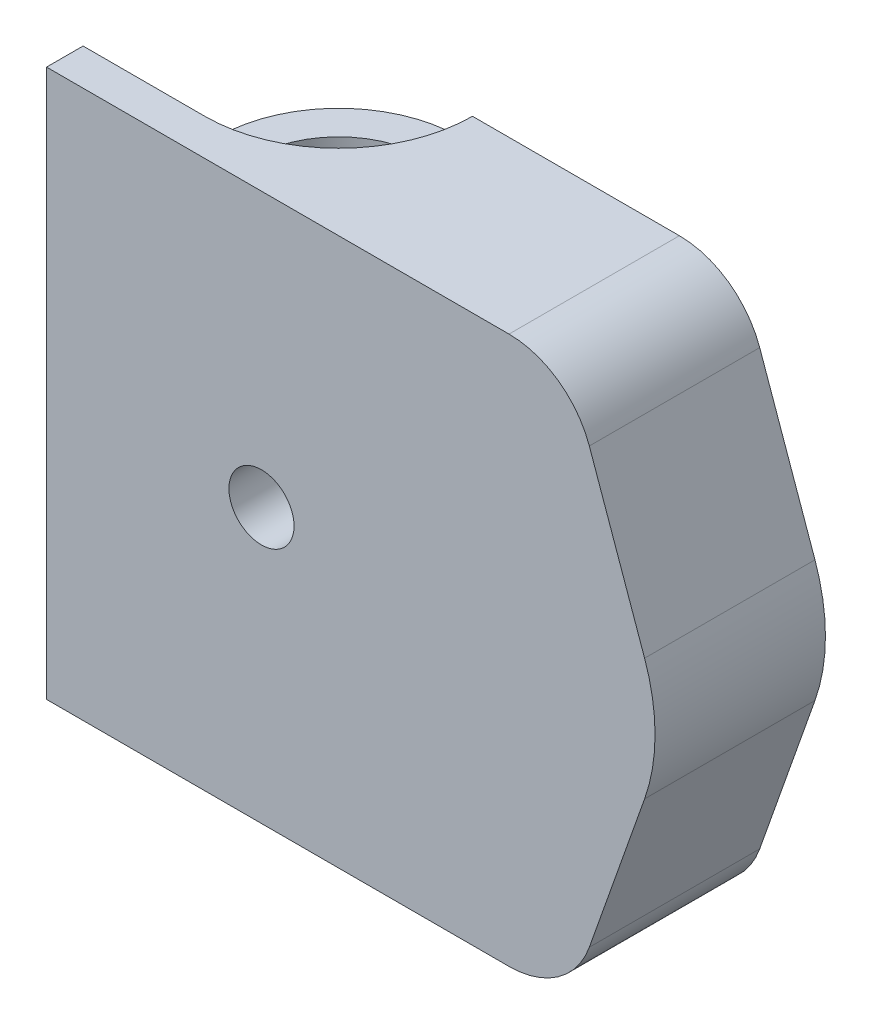
ISO-10303-21;
HEADER;
FILE_DESCRIPTION(('STEP AP214'),'2;1');
FILE_NAME('part.step','',(''),(''),'','','');
FILE_SCHEMA(('AUTOMOTIVE_DESIGN { 1 0 10303 214 1 1 1 1 }'));
ENDSEC;
DATA;
#1=APPLICATION_CONTEXT('core data for automotive mechanical design processes');
#2=APPLICATION_PROTOCOL_DEFINITION('international standard','automotive_design',2000,#1);
#3=PRODUCT_CONTEXT('',#1,'mechanical');
#4=PRODUCT('Part','Part','',(#3));
#5=PRODUCT_RELATED_PRODUCT_CATEGORY('part','',(#4));
#6=PRODUCT_DEFINITION_FORMATION('','',#4);
#7=PRODUCT_DEFINITION_CONTEXT('part definition',#1,'design');
#8=PRODUCT_DEFINITION('design','',#6,#7);
#9=PRODUCT_DEFINITION_SHAPE('','',#8);
#10=(LENGTH_UNIT() NAMED_UNIT(*) SI_UNIT(.MILLI.,.METRE.));
#11=(NAMED_UNIT(*) PLANE_ANGLE_UNIT() SI_UNIT($,.RADIAN.));
#12=(NAMED_UNIT(*) SI_UNIT($,.STERADIAN.) SOLID_ANGLE_UNIT());
#13=UNCERTAINTY_MEASURE_WITH_UNIT(LENGTH_MEASURE(1.E-05),#10,'distance_accuracy_value','');
#14=(GEOMETRIC_REPRESENTATION_CONTEXT(3) GLOBAL_UNCERTAINTY_ASSIGNED_CONTEXT((#13)) GLOBAL_UNIT_ASSIGNED_CONTEXT((#10,
#11,#12)) REPRESENTATION_CONTEXT('',''));
#15=CARTESIAN_POINT('',(0.,0.,0.));
#16=DIRECTION('',(0.,0.,1.));
#17=DIRECTION('',(1.,0.,0.));
#18=AXIS2_PLACEMENT_3D('',#15,#16,#17);
#19=CARTESIAN_POINT('',(162.686214745336,25.0741943489475,0.));
#20=DIRECTION('',(0.,0.,1.));
#21=DIRECTION('',(1.,0.,0.));
#22=AXIS2_PLACEMENT_3D('',#19,#20,#21);
#23=PLANE('',#22);
#24=DIRECTION('',(0.,1.,0.));
#25=VECTOR('',#24,1.);
#26=CARTESIAN_POINT('',(157.827472335938,64.3719632178711,0.));
#27=LINE('',#26,#25);
#28=CARTESIAN_POINT('',(157.827472335938,64.3719632178711,0.));
#29=VERTEX_POINT('',#28);
#30=CARTESIAN_POINT('',(157.827472335938,70.6969632178711,0.));
#31=VERTEX_POINT('',#30);
#32=EDGE_CURVE('E354',#29,#31,#27,.T.);
#33=ORIENTED_EDGE('',*,*,#32,.T.);
#34=DIRECTION('',(1.,0.,0.));
#35=VECTOR('',#34,1.);
#36=CARTESIAN_POINT('',(162.686214745336,70.6969632178711,0.));
#37=LINE('',#36,#35);
#38=CARTESIAN_POINT('',(157.897909709804,70.6969632178711,0.));
#39=VERTEX_POINT('',#38);
#40=EDGE_CURVE('E309',#31,#39,#37,.T.);
#41=ORIENTED_EDGE('',*,*,#40,.T.);
#42=DIRECTION('',(0.500000000000001,0.866025403784438,0.));
#43=VECTOR('',#42,1.);
#44=CARTESIAN_POINT('',(139.33974755295,38.5532834670979,0.));
#45=LINE('',#44,#43);
#46=CARTESIAN_POINT('',(160.308347083671,74.8719632178711,0.));
#47=VERTEX_POINT('',#46);
#48=EDGE_CURVE('E312',#39,#47,#45,.T.);
#49=ORIENTED_EDGE('',*,*,#48,.T.);
#50=DIRECTION('',(-0.5,0.866025403784439,0.));
#51=VECTOR('',#50,1.);
#52=CARTESIAN_POINT('',(182.465880445224,36.4939896652589,0.));
#53=LINE('',#52,#51);
#54=CARTESIAN_POINT('',(157.897909709804,79.0469632178711,0.));
#55=VERTEX_POINT('',#54);
#56=EDGE_CURVE('E315',#47,#55,#53,.T.);
#57=ORIENTED_EDGE('',*,*,#56,.T.);
#58=DIRECTION('',(-1.,0.,0.));
#59=VECTOR('',#58,1.);
#60=CARTESIAN_POINT('',(162.686214745336,79.0469632178711,0.));
#61=LINE('',#60,#59);
#62=CARTESIAN_POINT('',(157.827472335938,79.0469632178711,0.));
#63=VERTEX_POINT('',#62);
#64=EDGE_CURVE('E287',#55,#63,#61,.T.);
#65=ORIENTED_EDGE('',*,*,#64,.T.);
#66=DIRECTION('',(0.,1.,0.));
#67=VECTOR('',#66,1.);
#68=CARTESIAN_POINT('',(157.827472335938,64.3719632178711,0.));
#69=LINE('',#68,#67);
#70=CARTESIAN_POINT('',(157.827472335938,85.3719632178711,0.));
#71=VERTEX_POINT('',#70);
#72=EDGE_CURVE('E391',#63,#71,#69,.T.);
#73=ORIENTED_EDGE('',*,*,#72,.T.);
#74=DIRECTION('',(-1.,0.,0.));
#75=VECTOR('',#74,1.);
#76=CARTESIAN_POINT('',(157.827472335938,85.3719632178711,0.));
#77=LINE('',#76,#75);
#78=CARTESIAN_POINT('',(158.827472335938,85.3719632178711,0.));
#79=VERTEX_POINT('',#78);
#80=EDGE_CURVE('E318',#79,#71,#77,.T.);
#81=ORIENTED_EDGE('',*,*,#80,.F.);
#82=DIRECTION('',(0.,-1.,0.));
#83=VECTOR('',#82,1.);
#84=CARTESIAN_POINT('',(158.827472335938,97.3719632178711,0.));
#85=LINE('',#84,#83);
#86=CARTESIAN_POINT('',(158.827472335938,97.3719632178711,0.));
#87=VERTEX_POINT('',#86);
#88=EDGE_CURVE('E321',#87,#79,#85,.T.);
#89=ORIENTED_EDGE('',*,*,#88,.F.);
#90=DIRECTION('',(-1.,0.,0.));
#91=VECTOR('',#90,1.);
#92=CARTESIAN_POINT('',(162.686214745336,97.3719632178711,0.));
#93=LINE('',#92,#91);
#94=CARTESIAN_POINT('',(175.827472335938,97.3719632178711,0.));
#95=VERTEX_POINT('',#94);
#96=EDGE_CURVE('E371',#95,#87,#93,.T.);
#97=ORIENTED_EDGE('',*,*,#96,.F.);
#98=CARTESIAN_POINT('',(175.827472335938,90.3719632178711,0.));
#99=DIRECTION('',(0.,0.,1.));
#100=DIRECTION('',(1.,0.,0.));
#101=AXIS2_PLACEMENT_3D('',#98,#99,#100);
#102=CIRCLE('',#101,7.);
#103=CARTESIAN_POINT('',(182.426294195061,92.7076751161052,0.));
#104=VERTEX_POINT('',#103);
#105=EDGE_CURVE('E368',#104,#95,#102,.T.);
#106=ORIENTED_EDGE('',*,*,#105,.F.);
#107=DIRECTION('',(0.333673128319162,-0.942688837017658,0.));
#108=VECTOR('',#107,1.);
#109=CARTESIAN_POINT('',(201.502584897519,38.8135950399,0.));
#110=LINE('',#109,#108);
#111=CARTESIAN_POINT('',(186.967804891203,79.8770601426586,0.));
#112=VERTEX_POINT('',#111);
#113=EDGE_CURVE('E365',#104,#112,#110,.T.);
#114=ORIENTED_EDGE('',*,*,#113,.T.);
#115=CARTESIAN_POINT('',(172.827472335938,74.8719632178711,0.));
#116=DIRECTION('',(0.,0.,1.));
#117=DIRECTION('',(1.,0.,0.));
#118=AXIS2_PLACEMENT_3D('',#115,#116,#117);
#119=CIRCLE('',#118,15.);
#120=CARTESIAN_POINT('',(186.967804891203,69.8668662930836,0.));
#121=VERTEX_POINT('',#120);
#122=EDGE_CURVE('E362',#121,#112,#119,.T.);
#123=ORIENTED_EDGE('',*,*,#122,.F.);
#124=DIRECTION('',(0.333673128319162,0.942688837017658,0.));
#125=VECTOR('',#124,1.);
#126=CARTESIAN_POINT('',(170.17481514717,22.4235373933423,0.));
#127=LINE('',#126,#125);
#128=CARTESIAN_POINT('',(182.426294195061,57.036251319637,0.));
#129=VERTEX_POINT('',#128);
#130=EDGE_CURVE('E357',#129,#121,#127,.T.);
#131=ORIENTED_EDGE('',*,*,#130,.F.);
#132=CARTESIAN_POINT('',(175.827472335938,59.3719632178711,0.));
#133=DIRECTION('',(0.,0.,1.));
#134=DIRECTION('',(1.,0.,0.));
#135=AXIS2_PLACEMENT_3D('',#132,#133,#134);
#136=CIRCLE('',#135,7.);
#137=CARTESIAN_POINT('',(175.827472335938,52.3719632178711,0.));
#138=VERTEX_POINT('',#137);
#139=EDGE_CURVE('E377',#138,#129,#136,.T.);
#140=ORIENTED_EDGE('',*,*,#139,.F.);
#141=DIRECTION('',(-1.,0.,0.));
#142=VECTOR('',#141,1.);
#143=CARTESIAN_POINT('',(162.686214745336,52.3719632178711,0.));
#144=LINE('',#143,#142);
#145=CARTESIAN_POINT('',(158.827472335938,52.3719632178711,0.));
#146=VERTEX_POINT('',#145);
#147=EDGE_CURVE('E374',#138,#146,#144,.T.);
#148=ORIENTED_EDGE('',*,*,#147,.T.);
#149=DIRECTION('',(0.,1.,0.));
#150=VECTOR('',#149,1.);
#151=CARTESIAN_POINT('',(158.827472335938,52.3719632178711,0.));
#152=LINE('',#151,#150);
#153=CARTESIAN_POINT('',(158.827472335938,64.3719632178711,0.));
#154=VERTEX_POINT('',#153);
#155=EDGE_CURVE('E326',#146,#154,#152,.T.);
#156=ORIENTED_EDGE('',*,*,#155,.T.);
#157=DIRECTION('',(1.,0.,0.));
#158=VECTOR('',#157,1.);
#159=CARTESIAN_POINT('',(157.827472335938,64.3719632178711,0.));
#160=LINE('',#159,#158);
#161=EDGE_CURVE('E324',#29,#154,#160,.T.);
#162=ORIENTED_EDGE('',*,*,#161,.F.);
#163=EDGE_LOOP('',(#33,#41,#49,#57,#65,#73,#81,#89,#97,#106,#114,#123,#131,#140,#148,#156,#162));
#164=FACE_BOUND('',#163,.T.);
#165=CARTESIAN_POINT('',(173.633919605938,74.8719632178711,0.));
#166=DIRECTION('',(0.,0.,1.));
#167=DIRECTION('',(1.,0.,0.));
#168=AXIS2_PLACEMENT_3D('',#165,#166,#167);
#169=CIRCLE('',#168,6.34999999999999);
#170=CARTESIAN_POINT('',(179.983919605938,74.8719632178711,0.));
#171=VERTEX_POINT('',#170);
#172=EDGE_CURVE('E406',#171,#171,#169,.F.);
#173=ORIENTED_EDGE('',*,*,#172,.F.);
#174=EDGE_LOOP('',(#173));
#175=FACE_BOUND('',#174,.T.);
#176=ADVANCED_FACE('F35',(#164,#175),#23,.F.);
#177=CARTESIAN_POINT('',(160.308347083671,74.8719632178711,-10.));
#178=DIRECTION('',(0.866025403784439,0.5,0.));
#179=DIRECTION('',(-0.5,0.866025403784439,0.));
#180=AXIS2_PLACEMENT_3D('',#177,#178,#179);
#181=PLANE('',#180);
#182=DIRECTION('',(0.,0.,1.));
#183=VECTOR('',#182,1.);
#184=CARTESIAN_POINT('',(160.308347083671,74.8719632178711,-10.));
#185=LINE('',#184,#183);
#186=CARTESIAN_POINT('',(160.308347083671,74.8719632178711,5.));
#187=VERTEX_POINT('',#186);
#188=EDGE_CURVE('E285',#47,#187,#185,.T.);
#189=ORIENTED_EDGE('',*,*,#188,.T.);
#190=DIRECTION('',(-0.500000000000001,0.866025403784438,0.));
#191=VECTOR('',#190,1.);
#192=CARTESIAN_POINT('',(160.308347083671,74.8719632178711,5.));
#193=LINE('',#192,#191);
#194=CARTESIAN_POINT('',(157.897909709804,79.0469632178711,5.));
#195=VERTEX_POINT('',#194);
#196=EDGE_CURVE('E281',#187,#195,#193,.T.);
#197=ORIENTED_EDGE('',*,*,#196,.T.);
#198=DIRECTION('',(0.,0.,1.));
#199=VECTOR('',#198,1.);
#200=CARTESIAN_POINT('',(157.897909709804,79.0469632178711,-10.));
#201=LINE('',#200,#199);
#202=EDGE_CURVE('E284',#55,#195,#201,.T.);
#203=ORIENTED_EDGE('',*,*,#202,.F.);
#204=ORIENTED_EDGE('',*,*,#56,.F.);
#205=EDGE_LOOP('',(#189,#197,#203,#204));
#206=FACE_BOUND('',#205,.T.);
#207=ADVANCED_FACE('F472',(#206),#181,.F.);
#208=CARTESIAN_POINT('',(157.897909709804,70.6969632178711,-10.));
#209=DIRECTION('',(0.866025403784438,-0.500000000000001,0.));
#210=DIRECTION('',(0.500000000000001,0.866025403784438,0.));
#211=AXIS2_PLACEMENT_3D('',#208,#209,#210);
#212=PLANE('',#211);
#213=DIRECTION('',(0.,0.,1.));
#214=VECTOR('',#213,1.);
#215=CARTESIAN_POINT('',(157.897909709804,70.6969632178711,-10.));
#216=LINE('',#215,#214);
#217=CARTESIAN_POINT('',(157.897909709804,70.6969632178711,5.));
#218=VERTEX_POINT('',#217);
#219=EDGE_CURVE('E288',#39,#218,#216,.T.);
#220=ORIENTED_EDGE('',*,*,#219,.T.);
#221=DIRECTION('',(0.499999999999999,0.866025403784439,0.));
#222=VECTOR('',#221,1.);
#223=CARTESIAN_POINT('',(157.897909709804,70.6969632178711,5.));
#224=LINE('',#223,#222);
#225=EDGE_CURVE('E278',#218,#187,#224,.T.);
#226=ORIENTED_EDGE('',*,*,#225,.T.);
#227=ORIENTED_EDGE('',*,*,#188,.F.);
#228=ORIENTED_EDGE('',*,*,#48,.F.);
#229=EDGE_LOOP('',(#220,#226,#227,#228));
#230=FACE_BOUND('',#229,.T.);
#231=ADVANCED_FACE('F468',(#230),#212,.F.);
#232=CARTESIAN_POINT('',(153.077034962071,70.6969632178711,-10.));
#233=DIRECTION('',(0.,-1.,0.));
#234=DIRECTION('',(0.,0.,-1.));
#235=AXIS2_PLACEMENT_3D('',#232,#233,#234);
#236=PLANE('',#235);
#237=DIRECTION('',(1.,0.,0.));
#238=VECTOR('',#237,1.);
#239=CARTESIAN_POINT('',(153.077034962071,70.6969632178711,5.));
#240=LINE('',#239,#238);
#241=CARTESIAN_POINT('',(153.077034962071,70.6969632178711,5.));
#242=VERTEX_POINT('',#241);
#243=EDGE_CURVE('E275',#242,#218,#240,.T.);
#244=ORIENTED_EDGE('',*,*,#243,.T.);
#245=ORIENTED_EDGE('',*,*,#219,.F.);
#246=ORIENTED_EDGE('',*,*,#40,.F.);
#247=CARTESIAN_POINT('',(147.827472335938,70.6969632178711,0.));
#248=DIRECTION('',(0.,-1.,0.));
#249=DIRECTION('',(0.,0.,-1.));
#250=AXIS2_PLACEMENT_3D('',#247,#248,#249);
#251=CIRCLE('',#250,9.99999999999999);
#252=CARTESIAN_POINT('',(153.077034962071,70.6969632178711,-8.51129204259292));
#253=VERTEX_POINT('',#252);
#254=EDGE_CURVE('E404',#31,#253,#251,.F.);
#255=ORIENTED_EDGE('',*,*,#254,.T.);
#256=DIRECTION('',(0.,0.,1.));
#257=VECTOR('',#256,1.);
#258=CARTESIAN_POINT('',(153.077034962071,70.6969632178711,-10.));
#259=LINE('',#258,#257);
#260=EDGE_CURVE('E290',#253,#242,#259,.T.);
#261=ORIENTED_EDGE('',*,*,#260,.T.);
#262=EDGE_LOOP('',(#244,#245,#246,#255,#261));
#263=FACE_BOUND('',#262,.T.);
#264=ADVANCED_FACE('F463',(#263),#236,.F.);
#265=CARTESIAN_POINT('',(150.666597588204,74.8719632178711,-10.));
#266=DIRECTION('',(-0.866025403784438,-0.500000000000002,0.));
#267=DIRECTION('',(0.500000000000002,-0.866025403784438,0.));
#268=AXIS2_PLACEMENT_3D('',#265,#266,#267);
#269=PLANE('',#268);
#270=DIRECTION('',(0.500000000000003,-0.866025403784437,0.));
#271=VECTOR('',#270,1.);
#272=CARTESIAN_POINT('',(150.666597588204,74.8719632178711,5.));
#273=LINE('',#272,#271);
#274=CARTESIAN_POINT('',(150.666597588204,74.8719632178711,5.));
#275=VERTEX_POINT('',#274);
#276=EDGE_CURVE('E273',#275,#242,#273,.T.);
#277=ORIENTED_EDGE('',*,*,#276,.T.);
#278=ORIENTED_EDGE('',*,*,#260,.F.);
#279=CARTESIAN_POINT('',(147.827472335938,79.7894724038484,0.));
#280=DIRECTION('',(-0.866025403784438,-0.500000000000002,0.));
#281=DIRECTION('',(-0.500000000000002,0.866025403784438,0.));
#282=AXIS2_PLACEMENT_3D('',#279,#280,#281);
#283=ELLIPSE('',#282,19.9999999999999,9.99999999999999);
#284=CARTESIAN_POINT('',(150.666597588204,74.8719632178711,-9.58850185388429));
#285=VERTEX_POINT('',#284);
#286=EDGE_CURVE('E402',#253,#285,#283,.F.);
#287=ORIENTED_EDGE('',*,*,#286,.T.);
#288=DIRECTION('',(0.,0.,1.));
#289=VECTOR('',#288,1.);
#290=CARTESIAN_POINT('',(150.666597588204,74.8719632178711,-10.));
#291=LINE('',#290,#289);
#292=CARTESIAN_POINT('',(150.666597588204,74.8719632178711,-2.04679451873963));
#293=VERTEX_POINT('',#292);
#294=EDGE_CURVE('E293',#285,#293,#291,.T.);
#295=ORIENTED_EDGE('',*,*,#294,.T.);
#296=CARTESIAN_POINT('',(147.827472335938,79.7894724038484,0.));
#297=DIRECTION('',(-0.866025403784438,-0.500000000000002,0.));
#298=DIRECTION('',(-0.500000000000002,0.866025403784438,0.));
#299=AXIS2_PLACEMENT_3D('',#296,#297,#298);
#300=ELLIPSE('',#299,6.99999999999996,3.49999999999999);
#301=CARTESIAN_POINT('',(150.666597588204,74.8719632178711,2.04679451873963));
#302=VERTEX_POINT('',#301);
#303=EDGE_CURVE('E306',#302,#293,#300,.F.);
#304=ORIENTED_EDGE('',*,*,#303,.F.);
#305=EDGE_CURVE('E294',#302,#275,#291,.T.);
#306=ORIENTED_EDGE('',*,*,#305,.T.);
#307=EDGE_LOOP('',(#277,#278,#287,#295,#304,#306));
#308=FACE_BOUND('',#307,.T.);
#309=ADVANCED_FACE('F788',(#308),#269,.F.);
#310=CARTESIAN_POINT('',(153.077034962071,79.0469632178711,-10.));
#311=DIRECTION('',(-0.866025403784439,0.499999999999999,0.));
#312=DIRECTION('',(-0.499999999999999,-0.866025403784439,0.));
#313=AXIS2_PLACEMENT_3D('',#310,#311,#312);
#314=PLANE('',#313);
#315=DIRECTION('',(-0.500000000000003,-0.866025403784437,0.));
#316=VECTOR('',#315,1.);
#317=CARTESIAN_POINT('',(153.077034962071,79.0469632178711,5.));
#318=LINE('',#317,#316);
#319=CARTESIAN_POINT('',(153.077034962071,79.0469632178711,5.));
#320=VERTEX_POINT('',#319);
#321=EDGE_CURVE('E271',#320,#275,#318,.T.);
#322=ORIENTED_EDGE('',*,*,#321,.T.);
#323=ORIENTED_EDGE('',*,*,#305,.F.);
#324=CARTESIAN_POINT('',(147.827472335938,69.9544540318936,0.));
#325=DIRECTION('',(-0.866025403784439,0.499999999999999,0.));
#326=DIRECTION('',(0.499999999999999,0.866025403784439,0.));
#327=AXIS2_PLACEMENT_3D('',#324,#325,#326);
#328=ELLIPSE('',#327,7.,3.49999999999999);
#329=EDGE_CURVE('E303',#293,#302,#328,.F.);
#330=ORIENTED_EDGE('',*,*,#329,.F.);
#331=ORIENTED_EDGE('',*,*,#294,.F.);
#332=CARTESIAN_POINT('',(147.827472335938,69.9544540318936,0.));
#333=DIRECTION('',(-0.866025403784439,0.499999999999999,0.));
#334=DIRECTION('',(0.499999999999999,0.866025403784439,0.));
#335=AXIS2_PLACEMENT_3D('',#332,#333,#334);
#336=ELLIPSE('',#335,20.,9.99999999999999);
#337=CARTESIAN_POINT('',(153.077034962071,79.0469632178711,-8.5112920425929));
#338=VERTEX_POINT('',#337);
#339=EDGE_CURVE('E399',#285,#338,#336,.F.);
#340=ORIENTED_EDGE('',*,*,#339,.T.);
#341=DIRECTION('',(0.,0.,1.));
#342=VECTOR('',#341,1.);
#343=CARTESIAN_POINT('',(153.077034962071,79.0469632178711,-10.));
#344=LINE('',#343,#342);
#345=EDGE_CURVE('E297',#338,#320,#344,.T.);
#346=ORIENTED_EDGE('',*,*,#345,.T.);
#347=EDGE_LOOP('',(#322,#323,#330,#331,#340,#346));
#348=FACE_BOUND('',#347,.T.);
#349=ADVANCED_FACE('F777',(#348),#314,.F.);
#350=CARTESIAN_POINT('',(157.897909709804,79.0469632178711,-10.));
#351=DIRECTION('',(0.,1.,0.));
#352=DIRECTION('',(0.,0.,1.));
#353=AXIS2_PLACEMENT_3D('',#350,#351,#352);
#354=PLANE('',#353);
#355=ORIENTED_EDGE('',*,*,#202,.T.);
#356=DIRECTION('',(-1.,0.,0.));
#357=VECTOR('',#356,1.);
#358=CARTESIAN_POINT('',(157.897909709804,79.0469632178711,5.));
#359=LINE('',#358,#357);
#360=EDGE_CURVE('E269',#195,#320,#359,.T.);
#361=ORIENTED_EDGE('',*,*,#360,.T.);
#362=ORIENTED_EDGE('',*,*,#345,.F.);
#363=CARTESIAN_POINT('',(147.827472335938,79.0469632178711,0.));
#364=DIRECTION('',(0.,1.,0.));
#365=DIRECTION('',(0.,0.,1.));
#366=AXIS2_PLACEMENT_3D('',#363,#364,#365);
#367=CIRCLE('',#366,9.99999999999999);
#368=EDGE_CURVE('E393',#338,#63,#367,.F.);
#369=ORIENTED_EDGE('',*,*,#368,.T.);
#370=ORIENTED_EDGE('',*,*,#64,.F.);
#371=EDGE_LOOP('',(#355,#361,#362,#369,#370));
#372=FACE_BOUND('',#371,.T.);
#373=ADVANCED_FACE('F525',(#372),#354,.F.);
#374=CARTESIAN_POINT('',(162.686214745336,97.3719632178711,10.));
#375=DIRECTION('',(0.,-1.,0.));
#376=DIRECTION('',(0.,0.,-1.));
#377=AXIS2_PLACEMENT_3D('',#374,#375,#376);
#378=PLANE('',#377);
#379=CARTESIAN_POINT('',(147.827472335938,97.3719632178711,0.));
#380=DIRECTION('',(0.,-1.,0.));
#381=DIRECTION('',(0.,0.,-1.));
#382=AXIS2_PLACEMENT_3D('',#379,#380,#381);
#383=CIRCLE('',#382,11.);
#384=CARTESIAN_POINT('',(147.827472335938,97.3719632178711,11.));
#385=VERTEX_POINT('',#384);
#386=EDGE_CURVE('E333',#385,#87,#383,.F.);
#387=ORIENTED_EDGE('',*,*,#386,.F.);
#388=DIRECTION('',(1.,0.,0.));
#389=VECTOR('',#388,1.);
#390=CARTESIAN_POINT('',(147.827472335938,97.3719632178711,11.));
#391=LINE('',#390,#389);
#392=CARTESIAN_POINT('',(137.827472335938,97.3719632178711,11.));
#393=VERTEX_POINT('',#392);
#394=EDGE_CURVE('E222',#393,#385,#391,.T.);
#395=ORIENTED_EDGE('',*,*,#394,.F.);
#396=DIRECTION('',(0.,0.,-1.));
#397=VECTOR('',#396,1.);
#398=CARTESIAN_POINT('',(137.827472335938,97.3719632178711,14.));
#399=LINE('',#398,#397);
#400=CARTESIAN_POINT('',(137.827472335938,97.3719632178711,14.));
#401=VERTEX_POINT('',#400);
#402=EDGE_CURVE('E258',#401,#393,#399,.T.);
#403=ORIENTED_EDGE('',*,*,#402,.F.);
#404=DIRECTION('',(-1.,0.,0.));
#405=VECTOR('',#404,1.);
#406=CARTESIAN_POINT('',(175.827472335938,97.3719632178711,14.));
#407=LINE('',#406,#405);
#408=CARTESIAN_POINT('',(175.827472335938,97.3719632178711,14.));
#409=VERTEX_POINT('',#408);
#410=EDGE_CURVE('E256',#409,#401,#407,.T.);
#411=ORIENTED_EDGE('',*,*,#410,.F.);
#412=DIRECTION('',(0.,0.,-1.));
#413=VECTOR('',#412,1.);
#414=CARTESIAN_POINT('',(175.827472335938,97.3719632178711,10.));
#415=LINE('',#414,#413);
#416=EDGE_CURVE('E383',#409,#95,#415,.T.);
#417=ORIENTED_EDGE('',*,*,#416,.T.);
#418=ORIENTED_EDGE('',*,*,#96,.T.);
#419=EDGE_LOOP('',(#387,#395,#403,#411,#417,#418));
#420=FACE_BOUND('',#419,.T.);
#421=ADVANCED_FACE('F445',(#420),#378,.F.);
#422=CARTESIAN_POINT('',(162.686214745336,52.3719632178711,10.));
#423=DIRECTION('',(0.,-1.,0.));
#424=DIRECTION('',(1.,0.,0.));
#425=AXIS2_PLACEMENT_3D('',#422,#423,#424);
#426=PLANE('',#425);
#427=DIRECTION('',(-1.,0.,0.));
#428=VECTOR('',#427,1.);
#429=CARTESIAN_POINT('',(147.827472335938,52.3719632178711,11.));
#430=LINE('',#429,#428);
#431=CARTESIAN_POINT('',(147.827472335938,52.3719632178711,11.));
#432=VERTEX_POINT('',#431);
#433=CARTESIAN_POINT('',(137.827472335938,52.3719632178711,11.));
#434=VERTEX_POINT('',#433);
#435=EDGE_CURVE('E211',#432,#434,#430,.T.);
#436=ORIENTED_EDGE('',*,*,#435,.F.);
#437=CARTESIAN_POINT('',(147.827472335938,52.3719632178711,0.));
#438=DIRECTION('',(0.,-1.,0.));
#439=DIRECTION('',(1.,0.,0.));
#440=AXIS2_PLACEMENT_3D('',#437,#438,#439);
#441=CIRCLE('',#440,11.);
#442=EDGE_CURVE('E330',#432,#146,#441,.F.);
#443=ORIENTED_EDGE('',*,*,#442,.T.);
#444=ORIENTED_EDGE('',*,*,#147,.F.);
#445=DIRECTION('',(0.,0.,-1.));
#446=VECTOR('',#445,1.);
#447=CARTESIAN_POINT('',(175.827472335938,52.3719632178711,10.));
#448=LINE('',#447,#446);
#449=CARTESIAN_POINT('',(175.827472335938,52.3719632178711,14.));
#450=VERTEX_POINT('',#449);
#451=EDGE_CURVE('E202',#450,#138,#448,.T.);
#452=ORIENTED_EDGE('',*,*,#451,.F.);
#453=DIRECTION('',(1.,0.,0.));
#454=VECTOR('',#453,1.);
#455=CARTESIAN_POINT('',(175.827472335938,52.3719632178711,14.));
#456=LINE('',#455,#454);
#457=CARTESIAN_POINT('',(137.827472335938,52.3719632178711,14.));
#458=VERTEX_POINT('',#457);
#459=EDGE_CURVE('E238',#458,#450,#456,.T.);
#460=ORIENTED_EDGE('',*,*,#459,.F.);
#461=DIRECTION('',(0.,0.,-1.));
#462=VECTOR('',#461,1.);
#463=CARTESIAN_POINT('',(137.827472335938,52.3719632178711,14.));
#464=LINE('',#463,#462);
#465=EDGE_CURVE('E261',#458,#434,#464,.T.);
#466=ORIENTED_EDGE('',*,*,#465,.T.);
#467=EDGE_LOOP('',(#436,#443,#444,#452,#460,#466));
#468=FACE_BOUND('',#467,.T.);
#469=ADVANCED_FACE('F423',(#468),#426,.T.);
#470=CARTESIAN_POINT('',(162.686214745336,64.3719632178711,10.));
#471=DIRECTION('',(0.,1.,0.));
#472=DIRECTION('',(0.,0.,1.));
#473=AXIS2_PLACEMENT_3D('',#470,#471,#472);
#474=PLANE('',#473);
#475=DIRECTION('',(0.,0.,-1.));
#476=VECTOR('',#475,1.);
#477=CARTESIAN_POINT('',(137.827472335938,64.3719632178711,10.));
#478=LINE('',#477,#476);
#479=CARTESIAN_POINT('',(137.827472335938,64.3719632178711,11.));
#480=VERTEX_POINT('',#479);
#481=CARTESIAN_POINT('',(137.827472335938,64.3719632178711,0.));
#482=VERTEX_POINT('',#481);
#483=EDGE_CURVE('E192',#480,#482,#478,.T.);
#484=ORIENTED_EDGE('',*,*,#483,.T.);
#485=CARTESIAN_POINT('',(147.827472335938,64.3719632178711,0.));
#486=DIRECTION('',(0.,1.,0.));
#487=DIRECTION('',(0.,0.,1.));
#488=AXIS2_PLACEMENT_3D('',#485,#486,#487);
#489=CIRCLE('',#488,10.);
#490=CARTESIAN_POINT('',(147.812275610385,64.3719632178711,-9.99998845296994));
#491=VERTEX_POINT('',#490);
#492=EDGE_CURVE('E11',#482,#491,#489,.F.);
#493=ORIENTED_EDGE('',*,*,#492,.T.);
#494=CARTESIAN_POINT('',(147.827472335938,64.3719632178711,0.));
#495=DIRECTION('',(0.,1.,0.));
#496=DIRECTION('',(0.,0.,1.));
#497=AXIS2_PLACEMENT_3D('',#494,#495,#496);
#498=CIRCLE('',#497,9.99999999999999);
#499=EDGE_CURVE('E348',#29,#491,#498,.T.);
#500=ORIENTED_EDGE('',*,*,#499,.F.);
#501=ORIENTED_EDGE('',*,*,#161,.T.);
#502=CARTESIAN_POINT('',(147.827472335938,64.3719632178711,0.));
#503=DIRECTION('',(0.,1.,0.));
#504=DIRECTION('',(0.,0.,-1.));
#505=AXIS2_PLACEMENT_3D('',#502,#503,#504);
#506=CIRCLE('',#505,11.);
#507=CARTESIAN_POINT('',(147.827472335938,64.3719632178711,11.));
#508=VERTEX_POINT('',#507);
#509=EDGE_CURVE('E217',#508,#154,#506,.T.);
#510=ORIENTED_EDGE('',*,*,#509,.F.);
#511=DIRECTION('',(-1.,0.,0.));
#512=VECTOR('',#511,1.);
#513=CARTESIAN_POINT('',(147.827472335938,64.3719632178711,11.));
#514=LINE('',#513,#512);
#515=EDGE_CURVE('E208',#508,#480,#514,.T.);
#516=ORIENTED_EDGE('',*,*,#515,.T.);
#517=EDGE_LOOP('',(#484,#493,#500,#501,#510,#516));
#518=FACE_BOUND('',#517,.T.);
#519=CARTESIAN_POINT('',(147.827472335938,64.3719632178711,0.));
#520=DIRECTION('',(0.,-1.,0.));
#521=DIRECTION('',(0.,0.,-1.));
#522=AXIS2_PLACEMENT_3D('',#519,#520,#521);
#523=CIRCLE('',#522,7.12499999999999);
#524=CARTESIAN_POINT('',(147.827472335938,64.3719632178711,-7.12499999999999));
#525=VERTEX_POINT('',#524);
#526=EDGE_CURVE('E338',#525,#525,#523,.T.);
#527=ORIENTED_EDGE('',*,*,#526,.F.);
#528=EDGE_LOOP('',(#527));
#529=FACE_BOUND('',#528,.T.);
#530=ADVANCED_FACE('F214',(#518,#529),#474,.F.);
#531=CARTESIAN_POINT('',(162.686214745336,85.3719632178711,10.));
#532=DIRECTION('',(0.,1.,0.));
#533=DIRECTION('',(-1.,0.,0.));
#534=AXIS2_PLACEMENT_3D('',#531,#532,#533);
#535=PLANE('',#534);
#536=CARTESIAN_POINT('',(147.827472335938,85.3719632178712,0.));
#537=DIRECTION('',(0.,1.,0.));
#538=DIRECTION('',(0.,0.,1.));
#539=AXIS2_PLACEMENT_3D('',#536,#537,#538);
#540=CIRCLE('',#539,9.99999999999999);
#541=CARTESIAN_POINT('',(147.812275610385,85.3719632178712,-9.99998845296994));
#542=VERTEX_POINT('',#541);
#543=EDGE_CURVE('E352',#71,#542,#540,.T.);
#544=ORIENTED_EDGE('',*,*,#543,.T.);
#545=CARTESIAN_POINT('',(147.827472335938,85.3719632178711,0.));
#546=DIRECTION('',(0.,1.,0.));
#547=DIRECTION('',(-1.,0.,0.));
#548=AXIS2_PLACEMENT_3D('',#545,#546,#547);
#549=CIRCLE('',#548,10.);
#550=CARTESIAN_POINT('',(137.827472335938,85.3719632178711,0.));
#551=VERTEX_POINT('',#550);
#552=EDGE_CURVE('E57',#542,#551,#549,.T.);
#553=ORIENTED_EDGE('',*,*,#552,.T.);
#554=DIRECTION('',(0.,0.,-1.));
#555=VECTOR('',#554,1.);
#556=CARTESIAN_POINT('',(137.827472335938,85.3719632178711,10.));
#557=LINE('',#556,#555);
#558=CARTESIAN_POINT('',(137.827472335938,85.3719632178711,11.));
#559=VERTEX_POINT('',#558);
#560=EDGE_CURVE('E201',#559,#551,#557,.T.);
#561=ORIENTED_EDGE('',*,*,#560,.F.);
#562=DIRECTION('',(-1.,0.,0.));
#563=VECTOR('',#562,1.);
#564=CARTESIAN_POINT('',(147.827472335938,85.3719632178711,11.));
#565=LINE('',#564,#563);
#566=CARTESIAN_POINT('',(147.827472335938,85.3719632178711,11.));
#567=VERTEX_POINT('',#566);
#568=EDGE_CURVE('E223',#567,#559,#565,.T.);
#569=ORIENTED_EDGE('',*,*,#568,.F.);
#570=CARTESIAN_POINT('',(147.827472335938,85.3719632178712,0.));
#571=DIRECTION('',(0.,-1.,0.));
#572=DIRECTION('',(0.,0.,1.));
#573=AXIS2_PLACEMENT_3D('',#570,#571,#572);
#574=CIRCLE('',#573,11.);
#575=EDGE_CURVE('E331',#79,#567,#574,.T.);
#576=ORIENTED_EDGE('',*,*,#575,.F.);
#577=ORIENTED_EDGE('',*,*,#80,.T.);
#578=EDGE_LOOP('',(#544,#553,#561,#569,#576,#577));
#579=FACE_BOUND('',#578,.T.);
#580=CARTESIAN_POINT('',(147.827472335938,85.3719632178712,0.));
#581=DIRECTION('',(0.,1.,0.));
#582=DIRECTION('',(0.,0.,1.));
#583=AXIS2_PLACEMENT_3D('',#580,#581,#582);
#584=CIRCLE('',#583,7.12499999999999);
#585=CARTESIAN_POINT('',(147.827472335938,85.3719632178712,7.12499999999999));
#586=VERTEX_POINT('',#585);
#587=EDGE_CURVE('E345',#586,#586,#584,.T.);
#588=ORIENTED_EDGE('',*,*,#587,.F.);
#589=EDGE_LOOP('',(#588));
#590=FACE_BOUND('',#589,.T.);
#591=ADVANCED_FACE('F450',(#579,#590),#535,.T.);
#592=CARTESIAN_POINT('',(147.827472335938,52.3719632178711,0.));
#593=DIRECTION('',(0.,1.,0.));
#594=DIRECTION('',(0.,0.,1.));
#595=AXIS2_PLACEMENT_3D('',#592,#593,#594);
#596=CYLINDRICAL_SURFACE('',#595,3.49999999999999);
#597=ORIENTED_EDGE('',*,*,#329,.T.);
#598=ORIENTED_EDGE('',*,*,#303,.T.);
#599=EDGE_LOOP('',(#597,#598));
#600=FACE_BOUND('',#599,.T.);
#601=CARTESIAN_POINT('',(147.827472335938,80.3719632178712,0.));
#602=DIRECTION('',(0.,1.,0.));
#603=DIRECTION('',(0.,0.,1.));
#604=AXIS2_PLACEMENT_3D('',#601,#602,#603);
#605=CIRCLE('',#604,3.49999999999999);
#606=CARTESIAN_POINT('',(147.827472335938,80.3719632178712,3.49999999999999));
#607=VERTEX_POINT('',#606);
#608=EDGE_CURVE('E344',#607,#607,#605,.F.);
#609=ORIENTED_EDGE('',*,*,#608,.F.);
#610=EDGE_LOOP('',(#609));
#611=FACE_BOUND('',#610,.T.);
#612=CARTESIAN_POINT('',(147.827472335938,69.3719632178711,0.));
#613=DIRECTION('',(0.,-1.,0.));
#614=DIRECTION('',(0.,0.,-1.));
#615=AXIS2_PLACEMENT_3D('',#612,#613,#614);
#616=CIRCLE('',#615,3.49999999999999);
#617=CARTESIAN_POINT('',(147.827472335938,69.3719632178711,-3.49999999999999));
#618=VERTEX_POINT('',#617);
#619=EDGE_CURVE('E337',#618,#618,#616,.F.);
#620=ORIENTED_EDGE('',*,*,#619,.F.);
#621=EDGE_LOOP('',(#620));
#622=FACE_BOUND('',#621,.T.);
#623=ADVANCED_FACE('F497',(#600,#611,#622),#596,.F.);
#624=CARTESIAN_POINT('',(170.17481514717,22.4235373933423,10.));
#625=DIRECTION('',(-0.942688837017658,0.333673128319162,0.));
#626=DIRECTION('',(-0.333673128319162,-0.942688837017658,0.));
#627=AXIS2_PLACEMENT_3D('',#624,#625,#626);
#628=PLANE('',#627);
#629=ORIENTED_EDGE('',*,*,#130,.T.);
#630=DIRECTION('',(0.,0.,-1.));
#631=VECTOR('',#630,1.);
#632=CARTESIAN_POINT('',(186.967804891203,69.8668662930836,10.));
#633=LINE('',#632,#631);
#634=CARTESIAN_POINT('',(186.967804891203,69.8668662930836,14.));
#635=VERTEX_POINT('',#634);
#636=EDGE_CURVE('E389',#635,#121,#633,.T.);
#637=ORIENTED_EDGE('',*,*,#636,.F.);
#638=DIRECTION('',(0.333673128319162,0.942688837017658,0.));
#639=VECTOR('',#638,1.);
#640=CARTESIAN_POINT('',(182.426294195061,57.036251319637,14.));
#641=LINE('',#640,#639);
#642=CARTESIAN_POINT('',(182.426294195061,57.036251319637,14.));
#643=VERTEX_POINT('',#642);
#644=EDGE_CURVE('E244',#643,#635,#641,.T.);
#645=ORIENTED_EDGE('',*,*,#644,.F.);
#646=DIRECTION('',(0.,0.,-1.));
#647=VECTOR('',#646,1.);
#648=CARTESIAN_POINT('',(182.426294195061,57.036251319637,10.));
#649=LINE('',#648,#647);
#650=EDGE_CURVE('E380',#643,#129,#649,.T.);
#651=ORIENTED_EDGE('',*,*,#650,.T.);
#652=EDGE_LOOP('',(#629,#637,#645,#651));
#653=FACE_BOUND('',#652,.T.);
#654=ADVANCED_FACE('F495',(#653),#628,.F.);
#655=CARTESIAN_POINT('',(172.827472335938,74.8719632178711,10.));
#656=DIRECTION('',(0.,0.,-1.));
#657=DIRECTION('',(-1.,0.,0.));
#658=AXIS2_PLACEMENT_3D('',#655,#656,#657);
#659=CYLINDRICAL_SURFACE('',#658,15.);
#660=ORIENTED_EDGE('',*,*,#122,.T.);
#661=DIRECTION('',(0.,0.,-1.));
#662=VECTOR('',#661,1.);
#663=CARTESIAN_POINT('',(186.967804891203,79.8770601426586,10.));
#664=LINE('',#663,#662);
#665=CARTESIAN_POINT('',(186.967804891203,79.8770601426586,14.));
#666=VERTEX_POINT('',#665);
#667=EDGE_CURVE('E387',#666,#112,#664,.T.);
#668=ORIENTED_EDGE('',*,*,#667,.F.);
#669=CARTESIAN_POINT('',(172.827472335938,74.8719632178711,14.));
#670=DIRECTION('',(0.,0.,1.));
#671=DIRECTION('',(1.,0.,0.));
#672=AXIS2_PLACEMENT_3D('',#669,#670,#671);
#673=CIRCLE('',#672,15.);
#674=EDGE_CURVE('E247',#635,#666,#673,.T.);
#675=ORIENTED_EDGE('',*,*,#674,.F.);
#676=ORIENTED_EDGE('',*,*,#636,.T.);
#677=EDGE_LOOP('',(#660,#668,#675,#676));
#678=FACE_BOUND('',#677,.T.);
#679=ADVANCED_FACE('F493',(#678),#659,.T.);
#680=CARTESIAN_POINT('',(201.502584897519,38.8135950399,10.));
#681=DIRECTION('',(0.942688837017658,0.333673128319162,0.));
#682=DIRECTION('',(-0.333673128319162,0.942688837017658,0.));
#683=AXIS2_PLACEMENT_3D('',#680,#681,#682);
#684=PLANE('',#683);
#685=ORIENTED_EDGE('',*,*,#113,.F.);
#686=DIRECTION('',(0.,0.,-1.));
#687=VECTOR('',#686,1.);
#688=CARTESIAN_POINT('',(182.426294195061,92.7076751161052,10.));
#689=LINE('',#688,#687);
#690=CARTESIAN_POINT('',(182.426294195061,92.7076751161052,14.));
#691=VERTEX_POINT('',#690);
#692=EDGE_CURVE('E385',#691,#104,#689,.T.);
#693=ORIENTED_EDGE('',*,*,#692,.F.);
#694=DIRECTION('',(-0.333673128319162,0.942688837017658,0.));
#695=VECTOR('',#694,1.);
#696=CARTESIAN_POINT('',(182.426294195061,92.7076751161052,14.));
#697=LINE('',#696,#695);
#698=EDGE_CURVE('E250',#666,#691,#697,.T.);
#699=ORIENTED_EDGE('',*,*,#698,.F.);
#700=ORIENTED_EDGE('',*,*,#667,.T.);
#701=EDGE_LOOP('',(#685,#693,#699,#700));
#702=FACE_BOUND('',#701,.T.);
#703=ADVANCED_FACE('F489',(#702),#684,.T.);
#704=CARTESIAN_POINT('',(175.827472335938,90.3719632178711,10.));
#705=DIRECTION('',(0.,0.,-1.));
#706=DIRECTION('',(-1.,0.,0.));
#707=AXIS2_PLACEMENT_3D('',#704,#705,#706);
#708=CYLINDRICAL_SURFACE('',#707,7.);
#709=ORIENTED_EDGE('',*,*,#105,.T.);
#710=ORIENTED_EDGE('',*,*,#416,.F.);
#711=CARTESIAN_POINT('',(175.827472335938,90.3719632178711,14.));
#712=DIRECTION('',(0.,0.,1.));
#713=DIRECTION('',(1.,0.,0.));
#714=AXIS2_PLACEMENT_3D('',#711,#712,#713);
#715=CIRCLE('',#714,7.00000000000001);
#716=EDGE_CURVE('E253',#691,#409,#715,.T.);
#717=ORIENTED_EDGE('',*,*,#716,.F.);
#718=ORIENTED_EDGE('',*,*,#692,.T.);
#719=EDGE_LOOP('',(#709,#710,#717,#718));
#720=FACE_BOUND('',#719,.T.);
#721=ADVANCED_FACE('F486',(#720),#708,.T.);
#722=CARTESIAN_POINT('',(137.827472335938,25.0741943489475,10.));
#723=DIRECTION('',(1.,0.,0.));
#724=DIRECTION('',(0.,0.,-1.));
#725=AXIS2_PLACEMENT_3D('',#722,#723,#724);
#726=PLANE('',#725);
#727=ORIENTED_EDGE('',*,*,#560,.T.);
#728=DIRECTION('',(0.,1.,0.));
#729=VECTOR('',#728,1.);
#730=CARTESIAN_POINT('',(137.827472335938,25.0741943489475,0.));
#731=LINE('',#730,#729);
#732=EDGE_CURVE('E43',#551,#482,#731,.F.);
#733=ORIENTED_EDGE('',*,*,#732,.T.);
#734=ORIENTED_EDGE('',*,*,#483,.F.);
#735=DIRECTION('',(0.,-1.,0.));
#736=VECTOR('',#735,1.);
#737=CARTESIAN_POINT('',(137.827472335938,78.98878619344,11.));
#738=LINE('',#737,#736);
#739=EDGE_CURVE('E196',#480,#434,#738,.T.);
#740=ORIENTED_EDGE('',*,*,#739,.T.);
#741=ORIENTED_EDGE('',*,*,#465,.F.);
#742=DIRECTION('',(0.,-1.,0.));
#743=VECTOR('',#742,1.);
#744=CARTESIAN_POINT('',(137.827472335938,85.3719632178711,14.));
#745=LINE('',#744,#743);
#746=EDGE_CURVE('E236',#401,#458,#745,.T.);
#747=ORIENTED_EDGE('',*,*,#746,.F.);
#748=ORIENTED_EDGE('',*,*,#402,.T.);
#749=DIRECTION('',(0.,1.,0.));
#750=VECTOR('',#749,1.);
#751=CARTESIAN_POINT('',(137.827472335938,70.7551402423022,11.));
#752=LINE('',#751,#750);
#753=EDGE_CURVE('E230',#559,#393,#752,.T.);
#754=ORIENTED_EDGE('',*,*,#753,.F.);
#755=EDGE_LOOP('',(#727,#733,#734,#740,#741,#747,#748,#754));
#756=FACE_BOUND('',#755,.T.);
#757=ADVANCED_FACE('F194',(#756),#726,.F.);
#758=CARTESIAN_POINT('',(175.827472335938,59.3719632178711,10.));
#759=DIRECTION('',(0.,0.,-1.));
#760=DIRECTION('',(-1.,0.,0.));
#761=AXIS2_PLACEMENT_3D('',#758,#759,#760);
#762=CYLINDRICAL_SURFACE('',#761,7.);
#763=ORIENTED_EDGE('',*,*,#139,.T.);
#764=ORIENTED_EDGE('',*,*,#650,.F.);
#765=CARTESIAN_POINT('',(175.827472335938,59.3719632178711,14.));
#766=DIRECTION('',(0.,0.,1.));
#767=DIRECTION('',(1.,0.,0.));
#768=AXIS2_PLACEMENT_3D('',#765,#766,#767);
#769=CIRCLE('',#768,7.);
#770=EDGE_CURVE('E241',#450,#643,#769,.T.);
#771=ORIENTED_EDGE('',*,*,#770,.F.);
#772=ORIENTED_EDGE('',*,*,#451,.T.);
#773=EDGE_LOOP('',(#763,#764,#771,#772));
#774=FACE_BOUND('',#773,.T.);
#775=ADVANCED_FACE('F432',(#774),#762,.T.);
#776=CARTESIAN_POINT('',(147.827472335938,64.3719632178711,0.));
#777=DIRECTION('',(0.,1.,0.));
#778=DIRECTION('',(0.,0.,1.));
#779=AXIS2_PLACEMENT_3D('',#776,#777,#778);
#780=CYLINDRICAL_SURFACE('',#779,9.99999999999999);
#781=ORIENTED_EDGE('',*,*,#254,.F.);
#782=ORIENTED_EDGE('',*,*,#32,.F.);
#783=ORIENTED_EDGE('',*,*,#499,.T.);
#784=DIRECTION('',(0.,1.,0.));
#785=VECTOR('',#784,1.);
#786=CARTESIAN_POINT('',(147.812275610385,64.3719632178711,-9.99998845296994));
#787=LINE('',#786,#785);
#788=EDGE_CURVE('E351',#491,#542,#787,.T.);
#789=ORIENTED_EDGE('',*,*,#788,.T.);
#790=ORIENTED_EDGE('',*,*,#543,.F.);
#791=ORIENTED_EDGE('',*,*,#72,.F.);
#792=ORIENTED_EDGE('',*,*,#368,.F.);
#793=ORIENTED_EDGE('',*,*,#339,.F.);
#794=ORIENTED_EDGE('',*,*,#286,.F.);
#795=EDGE_LOOP('',(#781,#782,#783,#789,#790,#791,#792,#793,#794));
#796=FACE_BOUND('',#795,.T.);
#797=ADVANCED_FACE('F458',(#796),#780,.T.);
#798=CARTESIAN_POINT('',(147.827472335938,80.3719632178712,0.));
#799=DIRECTION('',(0.,1.,0.));
#800=DIRECTION('',(0.,0.,1.));
#801=AXIS2_PLACEMENT_3D('',#798,#799,#800);
#802=PLANE('',#801);
#803=CARTESIAN_POINT('',(147.827472335938,80.3719632178712,0.));
#804=DIRECTION('',(0.,1.,0.));
#805=DIRECTION('',(0.,0.,1.));
#806=AXIS2_PLACEMENT_3D('',#803,#804,#805);
#807=CIRCLE('',#806,7.12499999999999);
#808=CARTESIAN_POINT('',(147.827472335938,80.3719632178712,7.12499999999999));
#809=VERTEX_POINT('',#808);
#810=EDGE_CURVE('E341',#809,#809,#807,.T.);
#811=ORIENTED_EDGE('',*,*,#810,.T.);
#812=EDGE_LOOP('',(#811));
#813=FACE_BOUND('',#812,.T.);
#814=ORIENTED_EDGE('',*,*,#608,.T.);
#815=EDGE_LOOP('',(#814));
#816=FACE_BOUND('',#815,.T.);
#817=ADVANCED_FACE('F556',(#813,#816),#802,.T.);
#818=CARTESIAN_POINT('',(147.827472335938,80.3719632178712,0.));
#819=DIRECTION('',(0.,1.,0.));
#820=DIRECTION('',(0.,0.,1.));
#821=AXIS2_PLACEMENT_3D('',#818,#819,#820);
#822=CYLINDRICAL_SURFACE('',#821,7.12499999999999);
#823=ORIENTED_EDGE('',*,*,#810,.F.);
#824=EDGE_LOOP('',(#823));
#825=FACE_BOUND('',#824,.T.);
#826=ORIENTED_EDGE('',*,*,#587,.T.);
#827=EDGE_LOOP('',(#826));
#828=FACE_BOUND('',#827,.T.);
#829=ADVANCED_FACE('F566',(#825,#828),#822,.F.);
#830=CARTESIAN_POINT('',(147.827472335938,69.3719632178711,0.));
#831=DIRECTION('',(0.,-1.,0.));
#832=DIRECTION('',(0.,0.,-1.));
#833=AXIS2_PLACEMENT_3D('',#830,#831,#832);
#834=PLANE('',#833);
#835=CARTESIAN_POINT('',(147.827472335938,69.3719632178711,0.));
#836=DIRECTION('',(0.,-1.,0.));
#837=DIRECTION('',(0.,0.,-1.));
#838=AXIS2_PLACEMENT_3D('',#835,#836,#837);
#839=CIRCLE('',#838,7.12499999999999);
#840=CARTESIAN_POINT('',(147.827472335938,69.3719632178711,-7.12499999999999));
#841=VERTEX_POINT('',#840);
#842=EDGE_CURVE('E334',#841,#841,#839,.T.);
#843=ORIENTED_EDGE('',*,*,#842,.T.);
#844=EDGE_LOOP('',(#843));
#845=FACE_BOUND('',#844,.T.);
#846=ORIENTED_EDGE('',*,*,#619,.T.);
#847=EDGE_LOOP('',(#846));
#848=FACE_BOUND('',#847,.T.);
#849=ADVANCED_FACE('F573',(#845,#848),#834,.T.);
#850=CARTESIAN_POINT('',(147.827472335938,69.3719632178711,0.));
#851=DIRECTION('',(0.,-1.,0.));
#852=DIRECTION('',(0.,0.,-1.));
#853=AXIS2_PLACEMENT_3D('',#850,#851,#852);
#854=CYLINDRICAL_SURFACE('',#853,7.12499999999999);
#855=ORIENTED_EDGE('',*,*,#842,.F.);
#856=EDGE_LOOP('',(#855));
#857=FACE_BOUND('',#856,.T.);
#858=ORIENTED_EDGE('',*,*,#526,.T.);
#859=EDGE_LOOP('',(#858));
#860=FACE_BOUND('',#859,.T.);
#861=ADVANCED_FACE('F581',(#857,#860),#854,.F.);
#862=CARTESIAN_POINT('',(147.827472335938,105.033358143194,0.));
#863=DIRECTION('',(0.,-1.,0.));
#864=DIRECTION('',(0.,0.,-1.));
#865=AXIS2_PLACEMENT_3D('',#862,#863,#864);
#866=CYLINDRICAL_SURFACE('',#865,11.);
#867=ORIENTED_EDGE('',*,*,#575,.T.);
#868=DIRECTION('',(0.,1.,0.));
#869=VECTOR('',#868,1.);
#870=CARTESIAN_POINT('',(147.827472335938,70.7551402423022,11.));
#871=LINE('',#870,#869);
#872=EDGE_CURVE('E227',#567,#385,#871,.T.);
#873=ORIENTED_EDGE('',*,*,#872,.T.);
#874=ORIENTED_EDGE('',*,*,#386,.T.);
#875=ORIENTED_EDGE('',*,*,#88,.T.);
#876=EDGE_LOOP('',(#867,#873,#874,#875));
#877=FACE_BOUND('',#876,.T.);
#878=ADVANCED_FACE('F589',(#877),#866,.F.);
#879=CARTESIAN_POINT('',(147.827472335938,44.7105682925482,0.));
#880=DIRECTION('',(0.,1.,0.));
#881=DIRECTION('',(0.,0.,1.));
#882=AXIS2_PLACEMENT_3D('',#879,#880,#881);
#883=CYLINDRICAL_SURFACE('',#882,11.);
#884=ORIENTED_EDGE('',*,*,#442,.F.);
#885=DIRECTION('',(0.,-1.,0.));
#886=VECTOR('',#885,1.);
#887=CARTESIAN_POINT('',(147.827472335938,78.98878619344,11.));
#888=LINE('',#887,#886);
#889=EDGE_CURVE('E212',#508,#432,#888,.T.);
#890=ORIENTED_EDGE('',*,*,#889,.F.);
#891=ORIENTED_EDGE('',*,*,#509,.T.);
#892=ORIENTED_EDGE('',*,*,#155,.F.);
#893=EDGE_LOOP('',(#884,#890,#891,#892));
#894=FACE_BOUND('',#893,.T.);
#895=ADVANCED_FACE('F425',(#894),#883,.F.);
#896=CARTESIAN_POINT('',(153.077034962071,79.0469632178711,5.));
#897=DIRECTION('',(0.,0.,1.));
#898=DIRECTION('',(1.,0.,0.));
#899=AXIS2_PLACEMENT_3D('',#896,#897,#898);
#900=PLANE('',#899);
#901=CARTESIAN_POINT('',(155.487472335938,74.8719632178711,5.));
#902=DIRECTION('',(0.,0.,-1.));
#903=DIRECTION('',(-1.,0.,0.));
#904=AXIS2_PLACEMENT_3D('',#901,#902,#903);
#905=CIRCLE('',#904,2.675);
#906=CARTESIAN_POINT('',(152.812472335938,74.8719632178711,5.));
#907=VERTEX_POINT('',#906);
#908=EDGE_CURVE('E266',#907,#907,#905,.T.);
#909=ORIENTED_EDGE('',*,*,#908,.F.);
#910=EDGE_LOOP('',(#909));
#911=FACE_BOUND('',#910,.T.);
#912=ORIENTED_EDGE('',*,*,#360,.F.);
#913=ORIENTED_EDGE('',*,*,#196,.F.);
#914=ORIENTED_EDGE('',*,*,#225,.F.);
#915=ORIENTED_EDGE('',*,*,#243,.F.);
#916=ORIENTED_EDGE('',*,*,#276,.F.);
#917=ORIENTED_EDGE('',*,*,#321,.F.);
#918=EDGE_LOOP('',(#912,#913,#914,#915,#916,#917));
#919=FACE_BOUND('',#918,.T.);
#920=ADVANCED_FACE('F606',(#911,#919),#900,.F.);
#921=CARTESIAN_POINT('',(155.487472335938,74.8719632178711,15.));
#922=DIRECTION('',(0.,0.,-1.));
#923=DIRECTION('',(-1.,0.,0.));
#924=AXIS2_PLACEMENT_3D('',#921,#922,#923);
#925=CYLINDRICAL_SURFACE('',#924,2.675);
#926=ORIENTED_EDGE('',*,*,#908,.T.);
#927=EDGE_LOOP('',(#926));
#928=FACE_BOUND('',#927,.T.);
#929=CARTESIAN_POINT('',(155.487472335938,74.8719632178711,14.));
#930=DIRECTION('',(0.,0.,1.));
#931=DIRECTION('',(1.,0.,0.));
#932=AXIS2_PLACEMENT_3D('',#929,#930,#931);
#933=CIRCLE('',#932,2.675);
#934=CARTESIAN_POINT('',(158.162472335938,74.8719632178711,14.));
#935=VERTEX_POINT('',#934);
#936=EDGE_CURVE('E226',#935,#935,#933,.T.);
#937=ORIENTED_EDGE('',*,*,#936,.T.);
#938=EDGE_LOOP('',(#937));
#939=FACE_BOUND('',#938,.T.);
#940=ADVANCED_FACE('F615',(#928,#939),#925,.F.);
#941=CARTESIAN_POINT('',(173.633919605938,74.8719632178711,-1.5));
#942=DIRECTION('',(0.,0.,1.));
#943=DIRECTION('',(1.,0.,0.));
#944=AXIS2_PLACEMENT_3D('',#941,#942,#943);
#945=CYLINDRICAL_SURFACE('',#944,6.34999999999999);
#946=CARTESIAN_POINT('',(173.633919605938,74.8719632178711,-1.5));
#947=DIRECTION('',(0.,0.,-1.));
#948=DIRECTION('',(-1.,0.,0.));
#949=AXIS2_PLACEMENT_3D('',#946,#947,#948);
#950=CIRCLE('',#949,6.34999999999999);
#951=CARTESIAN_POINT('',(167.283919605938,74.8719632178711,-1.5));
#952=VERTEX_POINT('',#951);
#953=EDGE_CURVE('E263',#952,#952,#950,.T.);
#954=ORIENTED_EDGE('',*,*,#953,.F.);
#955=EDGE_LOOP('',(#954));
#956=FACE_BOUND('',#955,.T.);
#957=ORIENTED_EDGE('',*,*,#172,.T.);
#958=EDGE_LOOP('',(#957));
#959=FACE_BOUND('',#958,.T.);
#960=ADVANCED_FACE('F624',(#956,#959),#945,.T.);
#961=CARTESIAN_POINT('',(173.633919605938,74.8719632178711,-1.5));
#962=DIRECTION('',(0.,0.,-1.));
#963=DIRECTION('',(-1.,0.,0.));
#964=AXIS2_PLACEMENT_3D('',#961,#962,#963);
#965=PLANE('',#964);
#966=ORIENTED_EDGE('',*,*,#953,.T.);
#967=EDGE_LOOP('',(#966));
#968=FACE_BOUND('',#967,.T.);
#969=ADVANCED_FACE('F633',(#968),#965,.T.);
#970=CARTESIAN_POINT('',(175.827472335938,90.3719632178711,14.));
#971=DIRECTION('',(0.,0.,1.));
#972=DIRECTION('',(1.,0.,0.));
#973=AXIS2_PLACEMENT_3D('',#970,#971,#972);
#974=PLANE('',#973);
#975=ORIENTED_EDGE('',*,*,#746,.T.);
#976=ORIENTED_EDGE('',*,*,#459,.T.);
#977=ORIENTED_EDGE('',*,*,#770,.T.);
#978=ORIENTED_EDGE('',*,*,#644,.T.);
#979=ORIENTED_EDGE('',*,*,#674,.T.);
#980=ORIENTED_EDGE('',*,*,#698,.T.);
#981=ORIENTED_EDGE('',*,*,#716,.T.);
#982=ORIENTED_EDGE('',*,*,#410,.T.);
#983=EDGE_LOOP('',(#975,#976,#977,#978,#979,#980,#981,#982));
#984=FACE_BOUND('',#983,.T.);
#985=ORIENTED_EDGE('',*,*,#936,.F.);
#986=EDGE_LOOP('',(#985));
#987=FACE_BOUND('',#986,.T.);
#988=ADVANCED_FACE('F436',(#984,#987),#974,.T.);
#989=CARTESIAN_POINT('',(147.827472335938,70.7551402423022,11.));
#990=DIRECTION('',(0.,0.,1.));
#991=DIRECTION('',(1.,0.,0.));
#992=AXIS2_PLACEMENT_3D('',#989,#990,#991);
#993=PLANE('',#992);
#994=ORIENTED_EDGE('',*,*,#568,.T.);
#995=ORIENTED_EDGE('',*,*,#753,.T.);
#996=ORIENTED_EDGE('',*,*,#394,.T.);
#997=ORIENTED_EDGE('',*,*,#872,.F.);
#998=EDGE_LOOP('',(#994,#995,#996,#997));
#999=FACE_BOUND('',#998,.T.);
#1000=ADVANCED_FACE('F448',(#999),#993,.F.);
#1001=CARTESIAN_POINT('',(147.827472335938,78.98878619344,11.));
#1002=DIRECTION('',(0.,0.,1.));
#1003=DIRECTION('',(1.,0.,0.));
#1004=AXIS2_PLACEMENT_3D('',#1001,#1002,#1003);
#1005=PLANE('',#1004);
#1006=ORIENTED_EDGE('',*,*,#889,.T.);
#1007=ORIENTED_EDGE('',*,*,#435,.T.);
#1008=ORIENTED_EDGE('',*,*,#739,.F.);
#1009=ORIENTED_EDGE('',*,*,#515,.F.);
#1010=EDGE_LOOP('',(#1006,#1007,#1008,#1009));
#1011=FACE_BOUND('',#1010,.T.);
#1012=ADVANCED_FACE('F207',(#1011),#1005,.F.);
#1013=CARTESIAN_POINT('',(147.827472335938,64.3719632178711,0.));
#1014=DIRECTION('',(0.,1.,0.));
#1015=DIRECTION('',(0.,0.,1.));
#1016=AXIS2_PLACEMENT_3D('',#1013,#1014,#1015);
#1017=CYLINDRICAL_SURFACE('',#1016,10.);
#1018=ORIENTED_EDGE('',*,*,#492,.F.);
#1019=ORIENTED_EDGE('',*,*,#732,.F.);
#1020=ORIENTED_EDGE('',*,*,#552,.F.);
#1021=ORIENTED_EDGE('',*,*,#788,.F.);
#1022=EDGE_LOOP('',(#1018,#1019,#1020,#1021));
#1023=FACE_BOUND('',#1022,.T.);
#1024=ADVANCED_FACE('F37',(#1023),#1017,.T.);
#1025=CLOSED_SHELL('',(#176,#207,#231,#264,#309,#349,#373,#421,#469,#530,#591,#623,#654,#679,
#703,#721,#757,#775,#797,#817,#829,#849,#861,#878,#895,#920,#940,#960,#969,#988,#1000,#1012,#1024));
#1026=MANIFOLD_SOLID_BREP('B2',#1025);
#1027=ADVANCED_BREP_SHAPE_REPRESENTATION('',(#18,#1026),#14);
#1028=SHAPE_DEFINITION_REPRESENTATION(#9,#1027);
ENDSEC;
END-ISO-10303-21;
